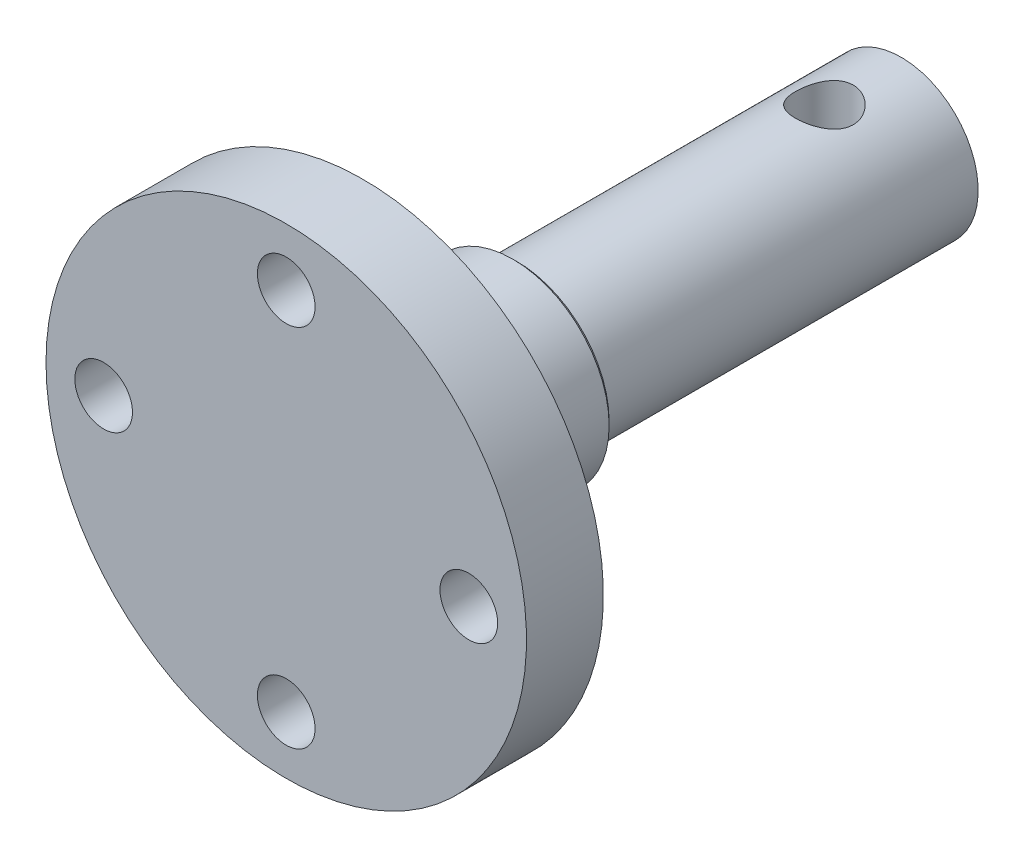
ISO-10303-21;
HEADER;
FILE_DESCRIPTION(('STEP AP214'),'2;1');
FILE_NAME('part.step','',(''),(''),'','','');
FILE_SCHEMA(('AUTOMOTIVE_DESIGN { 1 0 10303 214 1 1 1 1 }'));
ENDSEC;
DATA;
#1=APPLICATION_CONTEXT('core data for automotive mechanical design processes');
#2=APPLICATION_PROTOCOL_DEFINITION('international standard','automotive_design',2000,#1);
#3=PRODUCT_CONTEXT('',#1,'mechanical');
#4=PRODUCT('Part','Part','',(#3));
#5=PRODUCT_RELATED_PRODUCT_CATEGORY('part','',(#4));
#6=PRODUCT_DEFINITION_FORMATION('','',#4);
#7=PRODUCT_DEFINITION_CONTEXT('part definition',#1,'design');
#8=PRODUCT_DEFINITION('design','',#6,#7);
#9=PRODUCT_DEFINITION_SHAPE('','',#8);
#10=(LENGTH_UNIT() NAMED_UNIT(*) SI_UNIT(.MILLI.,.METRE.));
#11=(NAMED_UNIT(*) PLANE_ANGLE_UNIT() SI_UNIT($,.RADIAN.));
#12=(NAMED_UNIT(*) SI_UNIT($,.STERADIAN.) SOLID_ANGLE_UNIT());
#13=UNCERTAINTY_MEASURE_WITH_UNIT(LENGTH_MEASURE(1.E-05),#10,'distance_accuracy_value','');
#14=(GEOMETRIC_REPRESENTATION_CONTEXT(3) GLOBAL_UNCERTAINTY_ASSIGNED_CONTEXT((#13)) GLOBAL_UNIT_ASSIGNED_CONTEXT((#10,
#11,#12)) REPRESENTATION_CONTEXT('',''));
#15=CARTESIAN_POINT('',(0.,0.,0.));
#16=DIRECTION('',(0.,0.,1.));
#17=DIRECTION('',(1.,0.,0.));
#18=AXIS2_PLACEMENT_3D('',#15,#16,#17);
#19=CARTESIAN_POINT('',(12.5,0.,0.));
#20=DIRECTION('',(0.,0.,-1.));
#21=DIRECTION('',(-1.,0.,0.));
#22=AXIS2_PLACEMENT_3D('',#19,#20,#21);
#23=PLANE('',#22);
#24=CARTESIAN_POINT('',(-9.50000000000001,0.,0.));
#25=DIRECTION('',(0.,0.,-1.));
#26=DIRECTION('',(-1.,0.,0.));
#27=AXIS2_PLACEMENT_3D('',#24,#25,#26);
#28=CIRCLE('',#27,1.5);
#29=CARTESIAN_POINT('',(-11.,0.,0.));
#30=VERTEX_POINT('',#29);
#31=EDGE_CURVE('E112',#30,#30,#28,.T.);
#32=ORIENTED_EDGE('',*,*,#31,.T.);
#33=EDGE_LOOP('',(#32));
#34=FACE_BOUND('',#33,.T.);
#35=CARTESIAN_POINT('',(9.5,0.,0.));
#36=DIRECTION('',(0.,0.,-1.));
#37=DIRECTION('',(-1.,0.,0.));
#38=AXIS2_PLACEMENT_3D('',#35,#36,#37);
#39=CIRCLE('',#38,1.5);
#40=CARTESIAN_POINT('',(8.,0.,0.));
#41=VERTEX_POINT('',#40);
#42=EDGE_CURVE('E116',#41,#41,#39,.T.);
#43=ORIENTED_EDGE('',*,*,#42,.T.);
#44=EDGE_LOOP('',(#43));
#45=FACE_BOUND('',#44,.T.);
#46=CARTESIAN_POINT('',(0.,-9.49999999999998,0.));
#47=DIRECTION('',(0.,0.,-1.));
#48=DIRECTION('',(-1.,0.,0.));
#49=AXIS2_PLACEMENT_3D('',#46,#47,#48);
#50=CIRCLE('',#49,1.5);
#51=CARTESIAN_POINT('',(-1.50000000000001,-9.49999999999998,0.));
#52=VERTEX_POINT('',#51);
#53=EDGE_CURVE('E120',#52,#52,#50,.T.);
#54=ORIENTED_EDGE('',*,*,#53,.T.);
#55=EDGE_LOOP('',(#54));
#56=FACE_BOUND('',#55,.T.);
#57=CARTESIAN_POINT('',(0.,9.49999999999996,0.));
#58=DIRECTION('',(0.,0.,-1.));
#59=DIRECTION('',(-1.,0.,0.));
#60=AXIS2_PLACEMENT_3D('',#57,#58,#59);
#61=CIRCLE('',#60,1.5);
#62=CARTESIAN_POINT('',(-1.50000000000002,9.49999999999996,0.));
#63=VERTEX_POINT('',#62);
#64=EDGE_CURVE('E124',#63,#63,#61,.T.);
#65=ORIENTED_EDGE('',*,*,#64,.T.);
#66=EDGE_LOOP('',(#65));
#67=FACE_BOUND('',#66,.T.);
#68=CARTESIAN_POINT('',(0.,0.,0.));
#69=DIRECTION('',(0.,0.,-1.));
#70=DIRECTION('',(-1.,0.,0.));
#71=AXIS2_PLACEMENT_3D('',#68,#69,#70);
#72=CIRCLE('',#71,12.5);
#73=CARTESIAN_POINT('',(-12.5,0.,0.));
#74=VERTEX_POINT('',#73);
#75=EDGE_CURVE('E127',#74,#74,#72,.T.);
#76=ORIENTED_EDGE('',*,*,#75,.F.);
#77=EDGE_LOOP('',(#76));
#78=FACE_BOUND('',#77,.T.);
#79=ADVANCED_FACE('F32',(#34,#45,#56,#67,#78),#23,.F.);
#80=CARTESIAN_POINT('',(0.,0.,-32.));
#81=DIRECTION('',(0.,0.,1.));
#82=DIRECTION('',(1.,0.,0.));
#83=AXIS2_PLACEMENT_3D('',#80,#81,#82);
#84=PLANE('',#83);
#85=CARTESIAN_POINT('',(0.,0.,-32.));
#86=DIRECTION('',(0.,0.,-1.));
#87=DIRECTION('',(-1.,0.,0.));
#88=AXIS2_PLACEMENT_3D('',#85,#86,#87);
#89=CIRCLE('',#88,4.);
#90=CARTESIAN_POINT('',(-4.,0.,-32.));
#91=VERTEX_POINT('',#90);
#92=EDGE_CURVE('E50',#91,#91,#89,.T.);
#93=ORIENTED_EDGE('',*,*,#92,.T.);
#94=EDGE_LOOP('',(#93));
#95=FACE_BOUND('',#94,.T.);
#96=ADVANCED_FACE('F100',(#95),#84,.F.);
#97=CARTESIAN_POINT('',(0.,0.,0.));
#98=DIRECTION('',(0.,0.,-1.));
#99=DIRECTION('',(-1.,0.,0.));
#100=AXIS2_PLACEMENT_3D('',#97,#98,#99);
#101=CYLINDRICAL_SURFACE('',#100,4.);
#102=CARTESIAN_POINT('',(0.,-4.,-26.5));
#103=CARTESIAN_POINT('',(0.0812350589378531,-4.00000217456151,-26.4999970976969));
#104=CARTESIAN_POINT('',(0.162450241781793,-3.99750379283184,-26.5066197602484));
#105=CARTESIAN_POINT('',(0.322453452352362,-3.98778696006927,-26.5328281952699));
#106=CARTESIAN_POINT('',(0.401241827987617,-3.98056918893993,-26.5524121004706));
#107=CARTESIAN_POINT('',(0.554060784990879,-3.96218832391545,-26.6037530017718));
#108=CARTESIAN_POINT('',(0.628100224162278,-3.9510328434944,-26.6354865168218));
#109=CARTESIAN_POINT('',(0.769799310160254,-3.92588767765353,-26.7101064130158));
#110=CARTESIAN_POINT('',(0.83745723917788,-3.91189723227548,-26.7529957855442));
#111=CARTESIAN_POINT('',(0.967346417045827,-3.88186246971216,-26.8506125310709));
#112=CARTESIAN_POINT('',(1.02927073015119,-3.86576002583566,-26.9057302622594));
#113=CARTESIAN_POINT('',(1.14324421474363,-3.83360220871327,-27.0254104346588));
#114=CARTESIAN_POINT('',(1.19529036359203,-3.81754685135032,-27.0899757560879));
#115=CARTESIAN_POINT('',(1.28998202215985,-3.78662470617731,-27.2297174675232));
#116=CARTESIAN_POINT('',(1.3321939319576,-3.77182648820818,-27.3052043665458));
#117=CARTESIAN_POINT('',(1.40318646334085,-3.74599860237433,-27.4628483541685));
#118=CARTESIAN_POINT('',(1.43197244961239,-3.73496742975881,-27.5450027631551));
#119=CARTESIAN_POINT('',(1.47408431017549,-3.71854412824136,-27.7101167402582));
#120=CARTESIAN_POINT('',(1.48799593218558,-3.71293924350837,-27.7929050384354));
#121=CARTESIAN_POINT('',(1.50179556531648,-3.70738061461214,-27.9598161579938));
#122=CARTESIAN_POINT('',(1.50168936802631,-3.70742453659304,-28.0439384138745));
#123=CARTESIAN_POINT('',(1.48790429610018,-3.71297511632054,-28.205769525213));
#124=CARTESIAN_POINT('',(1.47503808509004,-3.71815468871121,-28.2835609060442));
#125=CARTESIAN_POINT('',(1.4374416786833,-3.73284938059529,-28.4357871504053));
#126=CARTESIAN_POINT('',(1.41270969663259,-3.74236515298863,-28.5102215066139));
#127=CARTESIAN_POINT('',(1.35163748571904,-3.76485702190253,-28.6552770677282));
#128=CARTESIAN_POINT('',(1.31508648737101,-3.77789517988166,-28.7257994861213));
#129=CARTESIAN_POINT('',(1.23156073762698,-3.80594210139319,-28.859945737591));
#130=CARTESIAN_POINT('',(1.18458238728897,-3.82095154457157,-28.9235671775197));
#131=CARTESIAN_POINT('',(1.07781780766549,-3.85248038859113,-29.0466036636509));
#132=CARTESIAN_POINT('',(1.01738298716956,-3.8690334745567,-29.1054486407481));
#133=CARTESIAN_POINT('',(0.887312590819023,-3.90091728164085,-29.2123379662058));
#134=CARTESIAN_POINT('',(0.817675603497367,-3.91624781465952,-29.2603806546057));
#135=CARTESIAN_POINT('',(0.669723436992422,-3.9442639480908,-29.3449303970625));
#136=CARTESIAN_POINT('',(0.591290713844721,-3.95690498259616,-29.3812475812211));
#137=CARTESIAN_POINT('',(0.428836850524584,-3.97778718326962,-29.43998260427));
#138=CARTESIAN_POINT('',(0.344818210845769,-3.98603030341493,-29.4624066165611));
#139=CARTESIAN_POINT('',(0.178375243148667,-3.99684443228065,-29.4916227875419));
#140=CARTESIAN_POINT('',(0.0961036195622106,-3.99969369025686,-29.4991826063825));
#141=CARTESIAN_POINT('',(-0.0685724752550236,-4.00025893700125,-29.5006910638999));
#142=CARTESIAN_POINT('',(-0.150976912983372,-3.99797606386863,-29.4946427203168));
#143=CARTESIAN_POINT('',(-0.31026204856186,-3.98871709772643,-29.4696899576913));
#144=CARTESIAN_POINT('',(-0.387233328007337,-3.98192470962305,-29.4512884562629));
#145=CARTESIAN_POINT('',(-0.536941754957222,-3.96451477091717,-29.4028139274527));
#146=CARTESIAN_POINT('',(-0.609678350347535,-3.9538967228203,-29.372739382052));
#147=CARTESIAN_POINT('',(-0.751247765110156,-3.92949624407681,-29.3008135875605));
#148=CARTESIAN_POINT('',(-0.819903083557796,-3.91563000209348,-29.2586422707766));
#149=CARTESIAN_POINT('',(-0.949392711726627,-3.88626671564664,-29.1640818968284));
#150=CARTESIAN_POINT('',(-1.01022412027045,-3.87076907009516,-29.1116890674549));
#151=CARTESIAN_POINT('',(-1.12603079874454,-3.83873329490989,-28.9945958778757));
#152=CARTESIAN_POINT('',(-1.18046154123569,-3.82218696503729,-28.9293578172273));
#153=CARTESIAN_POINT('',(-1.27771050031903,-3.79078815746853,-28.7903486152923));
#154=CARTESIAN_POINT('',(-1.32052767414519,-3.77593583194399,-28.7165767086115));
#155=CARTESIAN_POINT('',(-1.39337773518998,-3.74966829822463,-28.5619840132277));
#156=CARTESIAN_POINT('',(-1.42335685446918,-3.73826760328493,-28.4811352540896));
#157=CARTESIAN_POINT('',(-1.46907883466889,-3.72054032891005,-28.3149902363122));
#158=CARTESIAN_POINT('',(-1.48483050305535,-3.7142106105749,-28.2296967638019));
#159=CARTESIAN_POINT('',(-1.50086347097839,-3.70775894792573,-28.0629838404589));
#160=CARTESIAN_POINT('',(-1.50207331495838,-3.70726444523341,-27.9816673682831));
#161=CARTESIAN_POINT('',(-1.49136715641593,-3.71158412745292,-27.8200546837238));
#162=CARTESIAN_POINT('',(-1.47945239850124,-3.71639780898898,-27.7397583753284));
#163=CARTESIAN_POINT('',(-1.44355815630242,-3.73048141585432,-27.5849527732834));
#164=CARTESIAN_POINT('',(-1.41995798316524,-3.73961085376663,-27.5103416537547));
#165=CARTESIAN_POINT('',(-1.3616969677992,-3.76121548297845,-27.3660944915056));
#166=CARTESIAN_POINT('',(-1.32703332944945,-3.77369151995214,-27.2964597119299));
#167=CARTESIAN_POINT('',(-1.24552075938154,-3.80139723903964,-27.1601732103024));
#168=CARTESIAN_POINT('',(-1.1981283280301,-3.81673698440964,-27.0938692032001));
#169=CARTESIAN_POINT('',(-1.09334485729906,-3.84806246757177,-26.9698584390288));
#170=CARTESIAN_POINT('',(-1.03595064012808,-3.86404840943145,-26.9121544252132));
#171=CARTESIAN_POINT('',(-0.909080396784625,-3.89590424609881,-26.8037980441782));
#172=CARTESIAN_POINT('',(-0.839118644212994,-3.91172104900644,-26.7536962465653));
#173=CARTESIAN_POINT('',(-0.691213223200822,-3.9405451445703,-26.6659773447234));
#174=CARTESIAN_POINT('',(-0.613268934090622,-3.95355221851559,-26.6283612122636));
#175=CARTESIAN_POINT('',(-0.447999082002312,-3.9757429260668,-26.5656231709517));
#176=CARTESIAN_POINT('',(-0.360413422234209,-3.98473657158356,-26.5411129353981));
#177=CARTESIAN_POINT('',(-0.181875733606382,-3.99686242179586,-26.5083070400793));
#178=CARTESIAN_POINT('',(-0.0909254163648591,-3.99999756603967,-26.5000032485127));
#179=CARTESIAN_POINT('',(0.,-4.,-26.5));
#180=B_SPLINE_CURVE_WITH_KNOTS('',3,(#102,#103,#104,#105,#106,#107,#108,#109,#110,#111,#112,
#113,#114,#115,#116,#117,#118,#119,#120,#121,#122,#123,#124,#125,#126,#127,#128,#129,#130,#131,
#132,#133,#134,#135,#136,#137,#138,#139,#140,#141,#142,#143,#144,#145,#146,#147,#148,#149,#150,
#151,#152,#153,#154,#155,#156,#157,#158,#159,#160,#161,#162,#163,#164,#165,#166,#167,#168,#169,
#170,#171,#172,#173,#174,#175,#176,#177,#178,#179),.UNSPECIFIED.,.T.,.F.,(4,2,2,2,2,2,2,2,2,2,2,
2,2,2,2,2,2,2,2,2,2,2,2,2,2,2,2,2,2,2,2,2,2,2,2,2,2,2,4),(0.,0.24336980156056,0.486704549530461,
0.729571369213574,0.972503379609491,1.22473618582716,1.47704604925622,1.73896674501659,
2.00078269352134,2.25185874416902,2.50283106079707,2.73878345119972,2.9747713806059,
3.21522408387019,3.45575990744259,3.71246153335813,3.96920257905066,4.22991375286076,
4.49050899698846,4.73725019635926,4.98393668390521,5.22114437923841,5.45838293254454,
5.702592218596,5.94689180019869,6.20536519455659,6.46386178920142,6.72343066727205,
6.98283874956508,7.22558763480253,7.4683135021126,7.70363142426535,7.93900886656508,
8.18672471884272,8.43451941997063,8.6957232965404,8.95694749805104,9.22948515032044,
9.50188601796129),.UNSPECIFIED.);
#181=CARTESIAN_POINT('',(0.,-4.,-26.5));
#182=VERTEX_POINT('',#181);
#183=EDGE_CURVE('E36',#182,#182,#180,.T.);
#184=ORIENTED_EDGE('',*,*,#183,.T.);
#185=EDGE_LOOP('',(#184));
#186=FACE_BOUND('',#185,.T.);
#187=CARTESIAN_POINT('',(0.,4.,-26.5));
#188=CARTESIAN_POINT('',(-0.0812350589378531,4.00000217456151,-26.4999970976969));
#189=CARTESIAN_POINT('',(-0.162450241781793,3.99750379283184,-26.5066197602484));
#190=CARTESIAN_POINT('',(-0.322453452352362,3.98778696006927,-26.5328281952699));
#191=CARTESIAN_POINT('',(-0.401241827987617,3.98056918893993,-26.5524121004706));
#192=CARTESIAN_POINT('',(-0.554060784990879,3.96218832391545,-26.6037530017718));
#193=CARTESIAN_POINT('',(-0.628100224162278,3.9510328434944,-26.6354865168218));
#194=CARTESIAN_POINT('',(-0.769799310160254,3.92588767765353,-26.7101064130158));
#195=CARTESIAN_POINT('',(-0.83745723917788,3.91189723227548,-26.7529957855442));
#196=CARTESIAN_POINT('',(-0.967346417045827,3.88186246971216,-26.8506125310709));
#197=CARTESIAN_POINT('',(-1.02927073015119,3.86576002583566,-26.9057302622594));
#198=CARTESIAN_POINT('',(-1.14324421474363,3.83360220871327,-27.0254104346588));
#199=CARTESIAN_POINT('',(-1.19529036359203,3.81754685135032,-27.0899757560879));
#200=CARTESIAN_POINT('',(-1.28998202215985,3.78662470617731,-27.2297174675232));
#201=CARTESIAN_POINT('',(-1.3321939319576,3.77182648820818,-27.3052043665458));
#202=CARTESIAN_POINT('',(-1.40318646334085,3.74599860237433,-27.4628483541685));
#203=CARTESIAN_POINT('',(-1.43197244961239,3.73496742975881,-27.5450027631551));
#204=CARTESIAN_POINT('',(-1.47408431017549,3.71854412824136,-27.7101167402582));
#205=CARTESIAN_POINT('',(-1.48799593218558,3.71293924350837,-27.7929050384354));
#206=CARTESIAN_POINT('',(-1.50179556531648,3.70738061461214,-27.9598161579938));
#207=CARTESIAN_POINT('',(-1.50168936802631,3.70742453659304,-28.0439384138745));
#208=CARTESIAN_POINT('',(-1.48790429610018,3.71297511632054,-28.205769525213));
#209=CARTESIAN_POINT('',(-1.47503808509004,3.71815468871121,-28.2835609060442));
#210=CARTESIAN_POINT('',(-1.4374416786833,3.73284938059529,-28.4357871504053));
#211=CARTESIAN_POINT('',(-1.41270969663259,3.74236515298863,-28.5102215066139));
#212=CARTESIAN_POINT('',(-1.35163748571904,3.76485702190253,-28.6552770677282));
#213=CARTESIAN_POINT('',(-1.31508648737101,3.77789517988166,-28.7257994861213));
#214=CARTESIAN_POINT('',(-1.23156073762698,3.80594210139319,-28.859945737591));
#215=CARTESIAN_POINT('',(-1.18458238728897,3.82095154457157,-28.9235671775197));
#216=CARTESIAN_POINT('',(-1.07781780766549,3.85248038859113,-29.0466036636509));
#217=CARTESIAN_POINT('',(-1.01738298716956,3.8690334745567,-29.1054486407481));
#218=CARTESIAN_POINT('',(-0.887312590819023,3.90091728164085,-29.2123379662058));
#219=CARTESIAN_POINT('',(-0.817675603497367,3.91624781465952,-29.2603806546057));
#220=CARTESIAN_POINT('',(-0.669723436992422,3.9442639480908,-29.3449303970625));
#221=CARTESIAN_POINT('',(-0.591290713844721,3.95690498259616,-29.3812475812211));
#222=CARTESIAN_POINT('',(-0.428836850524584,3.97778718326962,-29.43998260427));
#223=CARTESIAN_POINT('',(-0.344818210845769,3.98603030341493,-29.4624066165611));
#224=CARTESIAN_POINT('',(-0.178375243148667,3.99684443228065,-29.4916227875419));
#225=CARTESIAN_POINT('',(-0.0961036195622106,3.99969369025686,-29.4991826063825));
#226=CARTESIAN_POINT('',(0.0685724752550236,4.00025893700125,-29.5006910638999));
#227=CARTESIAN_POINT('',(0.150976912983372,3.99797606386863,-29.4946427203168));
#228=CARTESIAN_POINT('',(0.31026204856186,3.98871709772643,-29.4696899576913));
#229=CARTESIAN_POINT('',(0.387233328007337,3.98192470962305,-29.4512884562629));
#230=CARTESIAN_POINT('',(0.536941754957222,3.96451477091717,-29.4028139274527));
#231=CARTESIAN_POINT('',(0.609678350347535,3.9538967228203,-29.372739382052));
#232=CARTESIAN_POINT('',(0.751247765110156,3.92949624407681,-29.3008135875605));
#233=CARTESIAN_POINT('',(0.819903083557796,3.91563000209348,-29.2586422707766));
#234=CARTESIAN_POINT('',(0.949392711726627,3.88626671564664,-29.1640818968284));
#235=CARTESIAN_POINT('',(1.01022412027045,3.87076907009516,-29.1116890674549));
#236=CARTESIAN_POINT('',(1.12603079874454,3.83873329490989,-28.9945958778757));
#237=CARTESIAN_POINT('',(1.18046154123569,3.82218696503729,-28.9293578172273));
#238=CARTESIAN_POINT('',(1.27771050031903,3.79078815746853,-28.7903486152923));
#239=CARTESIAN_POINT('',(1.32052767414519,3.77593583194399,-28.7165767086115));
#240=CARTESIAN_POINT('',(1.39337773518998,3.74966829822463,-28.5619840132277));
#241=CARTESIAN_POINT('',(1.42335685446918,3.73826760328493,-28.4811352540896));
#242=CARTESIAN_POINT('',(1.46907883466889,3.72054032891005,-28.3149902363122));
#243=CARTESIAN_POINT('',(1.48483050305535,3.7142106105749,-28.2296967638019));
#244=CARTESIAN_POINT('',(1.50086347097839,3.70775894792573,-28.0629838404589));
#245=CARTESIAN_POINT('',(1.50207331495838,3.70726444523341,-27.9816673682831));
#246=CARTESIAN_POINT('',(1.49136715641593,3.71158412745292,-27.8200546837238));
#247=CARTESIAN_POINT('',(1.47945239850124,3.71639780898898,-27.7397583753284));
#248=CARTESIAN_POINT('',(1.44355815630242,3.73048141585432,-27.5849527732834));
#249=CARTESIAN_POINT('',(1.41995798316524,3.73961085376663,-27.5103416537547));
#250=CARTESIAN_POINT('',(1.3616969677992,3.76121548297845,-27.3660944915056));
#251=CARTESIAN_POINT('',(1.32703332944945,3.77369151995214,-27.2964597119299));
#252=CARTESIAN_POINT('',(1.24552075938154,3.80139723903964,-27.1601732103024));
#253=CARTESIAN_POINT('',(1.1981283280301,3.81673698440964,-27.0938692032001));
#254=CARTESIAN_POINT('',(1.09334485729906,3.84806246757177,-26.9698584390288));
#255=CARTESIAN_POINT('',(1.03595064012808,3.86404840943145,-26.9121544252132));
#256=CARTESIAN_POINT('',(0.909080396784625,3.89590424609881,-26.8037980441782));
#257=CARTESIAN_POINT('',(0.839118644212994,3.91172104900644,-26.7536962465653));
#258=CARTESIAN_POINT('',(0.691213223200822,3.9405451445703,-26.6659773447234));
#259=CARTESIAN_POINT('',(0.613268934090622,3.95355221851559,-26.6283612122636));
#260=CARTESIAN_POINT('',(0.447999082002312,3.9757429260668,-26.5656231709517));
#261=CARTESIAN_POINT('',(0.360413422234209,3.98473657158356,-26.5411129353981));
#262=CARTESIAN_POINT('',(0.181875733606382,3.99686242179586,-26.5083070400793));
#263=CARTESIAN_POINT('',(0.0909254163648591,3.99999756603967,-26.5000032485127));
#264=CARTESIAN_POINT('',(0.,4.,-26.5));
#265=B_SPLINE_CURVE_WITH_KNOTS('',3,(#187,#188,#189,#190,#191,#192,#193,#194,#195,#196,#197,
#198,#199,#200,#201,#202,#203,#204,#205,#206,#207,#208,#209,#210,#211,#212,#213,#214,#215,#216,
#217,#218,#219,#220,#221,#222,#223,#224,#225,#226,#227,#228,#229,#230,#231,#232,#233,#234,#235,
#236,#237,#238,#239,#240,#241,#242,#243,#244,#245,#246,#247,#248,#249,#250,#251,#252,#253,#254,
#255,#256,#257,#258,#259,#260,#261,#262,#263,#264),.UNSPECIFIED.,.T.,.F.,(4,2,2,2,2,2,2,2,2,2,2,
2,2,2,2,2,2,2,2,2,2,2,2,2,2,2,2,2,2,2,2,2,2,2,2,2,2,2,4),(0.,0.24336980156056,0.486704549530461,
0.729571369213574,0.972503379609491,1.22473618582716,1.47704604925622,1.73896674501659,
2.00078269352134,2.25185874416902,2.50283106079707,2.73878345119972,2.9747713806059,
3.21522408387019,3.45575990744259,3.71246153335813,3.96920257905066,4.22991375286076,
4.49050899698846,4.73725019635926,4.98393668390521,5.22114437923841,5.45838293254454,
5.702592218596,5.94689180019869,6.20536519455659,6.46386178920142,6.72343066727205,
6.98283874956508,7.22558763480253,7.4683135021126,7.70363142426535,7.93900886656508,
8.18672471884272,8.43451941997063,8.6957232965404,8.95694749805104,9.22948515032044,
9.50188601796129),.UNSPECIFIED.);
#266=CARTESIAN_POINT('',(0.,4.,-26.5));
#267=VERTEX_POINT('',#266);
#268=EDGE_CURVE('E53',#267,#267,#265,.T.);
#269=ORIENTED_EDGE('',*,*,#268,.T.);
#270=EDGE_LOOP('',(#269));
#271=FACE_BOUND('',#270,.T.);
#272=ORIENTED_EDGE('',*,*,#92,.F.);
#273=EDGE_LOOP('',(#272));
#274=FACE_BOUND('',#273,.T.);
#275=CARTESIAN_POINT('',(0.,0.,-12.));
#276=DIRECTION('',(0.,0.,-1.));
#277=DIRECTION('',(-1.,0.,0.));
#278=AXIS2_PLACEMENT_3D('',#275,#276,#277);
#279=CIRCLE('',#278,4.);
#280=CARTESIAN_POINT('',(-4.,0.,-12.));
#281=VERTEX_POINT('',#280);
#282=EDGE_CURVE('E140',#281,#281,#279,.T.);
#283=ORIENTED_EDGE('',*,*,#282,.T.);
#284=EDGE_LOOP('',(#283));
#285=FACE_BOUND('',#284,.T.);
#286=ADVANCED_FACE('F58',(#186,#271,#274,#285),#101,.T.);
#287=CARTESIAN_POINT('',(4.,0.,-12.));
#288=DIRECTION('',(0.,0.,1.));
#289=DIRECTION('',(1.,0.,0.));
#290=AXIS2_PLACEMENT_3D('',#287,#288,#289);
#291=PLANE('',#290);
#292=CARTESIAN_POINT('',(0.,0.,-12.));
#293=DIRECTION('',(0.,0.,1.));
#294=DIRECTION('',(1.,0.,0.));
#295=AXIS2_PLACEMENT_3D('',#292,#293,#294);
#296=CIRCLE('',#295,4.8);
#297=CARTESIAN_POINT('',(4.8,0.,-12.));
#298=VERTEX_POINT('',#297);
#299=EDGE_CURVE('E45',#298,#298,#296,.F.);
#300=ORIENTED_EDGE('',*,*,#299,.T.);
#301=EDGE_LOOP('',(#300));
#302=FACE_BOUND('',#301,.T.);
#303=ORIENTED_EDGE('',*,*,#282,.F.);
#304=EDGE_LOOP('',(#303));
#305=FACE_BOUND('',#304,.T.);
#306=ADVANCED_FACE('F94',(#302,#305),#291,.F.);
#307=CARTESIAN_POINT('',(0.,0.,0.));
#308=DIRECTION('',(0.,0.,-1.));
#309=DIRECTION('',(-1.,0.,0.));
#310=AXIS2_PLACEMENT_3D('',#307,#308,#309);
#311=CYLINDRICAL_SURFACE('',#310,5.);
#312=CARTESIAN_POINT('',(0.,0.,-11.8));
#313=DIRECTION('',(0.,0.,1.));
#314=DIRECTION('',(1.,0.,0.));
#315=AXIS2_PLACEMENT_3D('',#312,#313,#314);
#316=CIRCLE('',#315,5.);
#317=CARTESIAN_POINT('',(5.,0.,-11.8));
#318=VERTEX_POINT('',#317);
#319=EDGE_CURVE('E10',#318,#318,#316,.T.);
#320=ORIENTED_EDGE('',*,*,#319,.T.);
#321=EDGE_LOOP('',(#320));
#322=FACE_BOUND('',#321,.T.);
#323=CARTESIAN_POINT('',(0.,0.,-4.));
#324=DIRECTION('',(0.,0.,-1.));
#325=DIRECTION('',(-1.,0.,0.));
#326=AXIS2_PLACEMENT_3D('',#323,#324,#325);
#327=CIRCLE('',#326,5.);
#328=CARTESIAN_POINT('',(-5.,0.,-4.));
#329=VERTEX_POINT('',#328);
#330=EDGE_CURVE('E132',#329,#329,#327,.T.);
#331=ORIENTED_EDGE('',*,*,#330,.T.);
#332=EDGE_LOOP('',(#331));
#333=FACE_BOUND('',#332,.T.);
#334=ADVANCED_FACE('F91',(#322,#333),#311,.T.);
#335=CARTESIAN_POINT('',(5.,0.,-4.));
#336=DIRECTION('',(0.,0.,1.));
#337=DIRECTION('',(1.,0.,0.));
#338=AXIS2_PLACEMENT_3D('',#335,#336,#337);
#339=PLANE('',#338);
#340=CARTESIAN_POINT('',(-9.50000000000001,0.,-4.));
#341=DIRECTION('',(0.,0.,-1.));
#342=DIRECTION('',(-1.,0.,0.));
#343=AXIS2_PLACEMENT_3D('',#340,#341,#342);
#344=CIRCLE('',#343,1.5);
#345=CARTESIAN_POINT('',(-11.,0.,-4.));
#346=VERTEX_POINT('',#345);
#347=EDGE_CURVE('E162',#346,#346,#344,.T.);
#348=ORIENTED_EDGE('',*,*,#347,.F.);
#349=EDGE_LOOP('',(#348));
#350=FACE_BOUND('',#349,.T.);
#351=CARTESIAN_POINT('',(9.5,0.,-4.));
#352=DIRECTION('',(0.,0.,-1.));
#353=DIRECTION('',(-1.,0.,0.));
#354=AXIS2_PLACEMENT_3D('',#351,#352,#353);
#355=CIRCLE('',#354,1.5);
#356=CARTESIAN_POINT('',(8.,0.,-4.));
#357=VERTEX_POINT('',#356);
#358=EDGE_CURVE('E158',#357,#357,#355,.T.);
#359=ORIENTED_EDGE('',*,*,#358,.F.);
#360=EDGE_LOOP('',(#359));
#361=FACE_BOUND('',#360,.T.);
#362=CARTESIAN_POINT('',(0.,-9.49999999999998,-4.));
#363=DIRECTION('',(0.,0.,-1.));
#364=DIRECTION('',(-1.,0.,0.));
#365=AXIS2_PLACEMENT_3D('',#362,#363,#364);
#366=CIRCLE('',#365,1.5);
#367=CARTESIAN_POINT('',(-1.50000000000001,-9.49999999999998,-4.));
#368=VERTEX_POINT('',#367);
#369=EDGE_CURVE('E154',#368,#368,#366,.T.);
#370=ORIENTED_EDGE('',*,*,#369,.F.);
#371=EDGE_LOOP('',(#370));
#372=FACE_BOUND('',#371,.T.);
#373=CARTESIAN_POINT('',(0.,9.49999999999996,-4.));
#374=DIRECTION('',(0.,0.,-1.));
#375=DIRECTION('',(-1.,0.,0.));
#376=AXIS2_PLACEMENT_3D('',#373,#374,#375);
#377=CIRCLE('',#376,1.5);
#378=CARTESIAN_POINT('',(-1.50000000000002,9.49999999999996,-4.));
#379=VERTEX_POINT('',#378);
#380=EDGE_CURVE('E134',#379,#379,#377,.T.);
#381=ORIENTED_EDGE('',*,*,#380,.F.);
#382=EDGE_LOOP('',(#381));
#383=FACE_BOUND('',#382,.T.);
#384=ORIENTED_EDGE('',*,*,#330,.F.);
#385=EDGE_LOOP('',(#384));
#386=FACE_BOUND('',#385,.T.);
#387=CARTESIAN_POINT('',(0.,0.,-4.));
#388=DIRECTION('',(0.,0.,-1.));
#389=DIRECTION('',(-1.,0.,0.));
#390=AXIS2_PLACEMENT_3D('',#387,#388,#389);
#391=CIRCLE('',#390,12.5);
#392=CARTESIAN_POINT('',(-12.5,0.,-4.));
#393=VERTEX_POINT('',#392);
#394=EDGE_CURVE('E129',#393,#393,#391,.T.);
#395=ORIENTED_EDGE('',*,*,#394,.T.);
#396=EDGE_LOOP('',(#395));
#397=FACE_BOUND('',#396,.T.);
#398=ADVANCED_FACE('F87',(#350,#361,#372,#383,#386,#397),#339,.F.);
#399=CARTESIAN_POINT('',(0.,0.,0.));
#400=DIRECTION('',(0.,0.,-1.));
#401=DIRECTION('',(-1.,0.,0.));
#402=AXIS2_PLACEMENT_3D('',#399,#400,#401);
#403=CYLINDRICAL_SURFACE('',#402,12.5);
#404=ORIENTED_EDGE('',*,*,#394,.F.);
#405=EDGE_LOOP('',(#404));
#406=FACE_BOUND('',#405,.T.);
#407=ORIENTED_EDGE('',*,*,#75,.T.);
#408=EDGE_LOOP('',(#407));
#409=FACE_BOUND('',#408,.T.);
#410=ADVANCED_FACE('F83',(#406,#409),#403,.T.);
#411=CARTESIAN_POINT('',(0.,9.49999999999996,0.));
#412=DIRECTION('',(0.,0.,-1.));
#413=DIRECTION('',(-1.,0.,0.));
#414=AXIS2_PLACEMENT_3D('',#411,#412,#413);
#415=CYLINDRICAL_SURFACE('',#414,1.5);
#416=ORIENTED_EDGE('',*,*,#64,.F.);
#417=EDGE_LOOP('',(#416));
#418=FACE_BOUND('',#417,.T.);
#419=ORIENTED_EDGE('',*,*,#380,.T.);
#420=EDGE_LOOP('',(#419));
#421=FACE_BOUND('',#420,.T.);
#422=ADVANCED_FACE('F79',(#418,#421),#415,.F.);
#423=CARTESIAN_POINT('',(0.,-9.49999999999998,0.));
#424=DIRECTION('',(0.,0.,-1.));
#425=DIRECTION('',(-1.,0.,0.));
#426=AXIS2_PLACEMENT_3D('',#423,#424,#425);
#427=CYLINDRICAL_SURFACE('',#426,1.5);
#428=ORIENTED_EDGE('',*,*,#53,.F.);
#429=EDGE_LOOP('',(#428));
#430=FACE_BOUND('',#429,.T.);
#431=ORIENTED_EDGE('',*,*,#369,.T.);
#432=EDGE_LOOP('',(#431));
#433=FACE_BOUND('',#432,.T.);
#434=ADVANCED_FACE('F75',(#430,#433),#427,.F.);
#435=CARTESIAN_POINT('',(9.5,0.,0.));
#436=DIRECTION('',(0.,0.,-1.));
#437=DIRECTION('',(-1.,0.,0.));
#438=AXIS2_PLACEMENT_3D('',#435,#436,#437);
#439=CYLINDRICAL_SURFACE('',#438,1.5);
#440=ORIENTED_EDGE('',*,*,#42,.F.);
#441=EDGE_LOOP('',(#440));
#442=FACE_BOUND('',#441,.T.);
#443=ORIENTED_EDGE('',*,*,#358,.T.);
#444=EDGE_LOOP('',(#443));
#445=FACE_BOUND('',#444,.T.);
#446=ADVANCED_FACE('F71',(#442,#445),#439,.F.);
#447=CARTESIAN_POINT('',(-9.50000000000001,0.,0.));
#448=DIRECTION('',(0.,0.,-1.));
#449=DIRECTION('',(-1.,0.,0.));
#450=AXIS2_PLACEMENT_3D('',#447,#448,#449);
#451=CYLINDRICAL_SURFACE('',#450,1.5);
#452=ORIENTED_EDGE('',*,*,#31,.F.);
#453=EDGE_LOOP('',(#452));
#454=FACE_BOUND('',#453,.T.);
#455=ORIENTED_EDGE('',*,*,#347,.T.);
#456=EDGE_LOOP('',(#455));
#457=FACE_BOUND('',#456,.T.);
#458=ADVANCED_FACE('F67',(#454,#457),#451,.F.);
#459=CARTESIAN_POINT('',(0.,0.,-12.));
#460=DIRECTION('',(0.,0.,1.));
#461=DIRECTION('',(1.,0.,0.));
#462=AXIS2_PLACEMENT_3D('',#459,#460,#461);
#463=CONICAL_SURFACE('',#462,4.8,0.785398163397448);
#464=ORIENTED_EDGE('',*,*,#319,.F.);
#465=EDGE_LOOP('',(#464));
#466=FACE_BOUND('',#465,.T.);
#467=ORIENTED_EDGE('',*,*,#299,.F.);
#468=EDGE_LOOP('',(#467));
#469=FACE_BOUND('',#468,.T.);
#470=ADVANCED_FACE('F34',(#466,#469),#463,.T.);
#471=CARTESIAN_POINT('',(0.,-12.5,-28.));
#472=DIRECTION('',(0.,1.,0.));
#473=DIRECTION('',(0.,0.,1.));
#474=AXIS2_PLACEMENT_3D('',#471,#472,#473);
#475=CYLINDRICAL_SURFACE('',#474,1.5);
#476=ORIENTED_EDGE('',*,*,#268,.F.);
#477=EDGE_LOOP('',(#476));
#478=FACE_BOUND('',#477,.T.);
#479=ORIENTED_EDGE('',*,*,#183,.F.);
#480=EDGE_LOOP('',(#479));
#481=FACE_BOUND('',#480,.T.);
#482=ADVANCED_FACE('F62',(#478,#481),#475,.F.);
#483=CLOSED_SHELL('',(#79,#96,#286,#306,#334,#398,#410,#422,#434,#446,#458,#470,#482));
#484=MANIFOLD_SOLID_BREP('B2',#483);
#485=ADVANCED_BREP_SHAPE_REPRESENTATION('',(#18,#484),#14);
#486=SHAPE_DEFINITION_REPRESENTATION(#9,#485);
ENDSEC;
END-ISO-10303-21;
